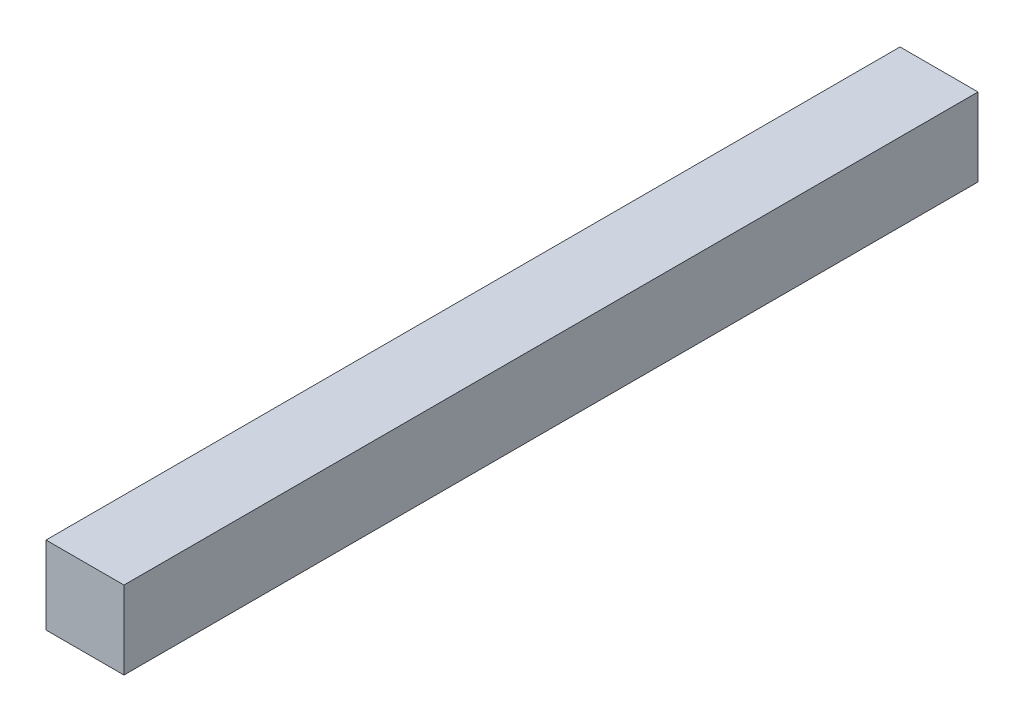
ISO-10303-21;
HEADER;
FILE_DESCRIPTION(('STEP AP214'),'2;1');
FILE_NAME('part.step','',(''),(''),'','','');
FILE_SCHEMA(('AUTOMOTIVE_DESIGN { 1 0 10303 214 1 1 1 1 }'));
ENDSEC;
DATA;
#1=APPLICATION_CONTEXT('core data for automotive mechanical design processes');
#2=APPLICATION_PROTOCOL_DEFINITION('international standard','automotive_design',2000,#1);
#3=PRODUCT_CONTEXT('',#1,'mechanical');
#4=PRODUCT('Part','Part','',(#3));
#5=PRODUCT_RELATED_PRODUCT_CATEGORY('part','',(#4));
#6=PRODUCT_DEFINITION_FORMATION('','',#4);
#7=PRODUCT_DEFINITION_CONTEXT('part definition',#1,'design');
#8=PRODUCT_DEFINITION('design','',#6,#7);
#9=PRODUCT_DEFINITION_SHAPE('','',#8);
#10=(LENGTH_UNIT() NAMED_UNIT(*) SI_UNIT(.MILLI.,.METRE.));
#11=(NAMED_UNIT(*) PLANE_ANGLE_UNIT() SI_UNIT($,.RADIAN.));
#12=(NAMED_UNIT(*) SI_UNIT($,.STERADIAN.) SOLID_ANGLE_UNIT());
#13=UNCERTAINTY_MEASURE_WITH_UNIT(LENGTH_MEASURE(1.E-05),#10,'distance_accuracy_value','');
#14=(GEOMETRIC_REPRESENTATION_CONTEXT(3) GLOBAL_UNCERTAINTY_ASSIGNED_CONTEXT((#13)) GLOBAL_UNIT_ASSIGNED_CONTEXT((#10,
#11,#12)) REPRESENTATION_CONTEXT('',''));
#15=CARTESIAN_POINT('',(0.,0.,0.));
#16=DIRECTION('',(0.,0.,1.));
#17=DIRECTION('',(1.,0.,0.));
#18=AXIS2_PLACEMENT_3D('',#15,#16,#17);
#19=CARTESIAN_POINT('',(21.,0.,460.));
#20=DIRECTION('',(-1.,0.,0.));
#21=DIRECTION('',(0.,0.,1.));
#22=AXIS2_PLACEMENT_3D('',#19,#20,#21);
#23=PLANE('',#22);
#24=DIRECTION('',(0.,1.,0.));
#25=VECTOR('',#24,1.);
#26=CARTESIAN_POINT('',(21.,0.,0.));
#27=LINE('',#26,#25);
#28=CARTESIAN_POINT('',(21.,-21.,0.));
#29=VERTEX_POINT('',#28);
#30=CARTESIAN_POINT('',(21.,21.,0.));
#31=VERTEX_POINT('',#30);
#32=EDGE_CURVE('E125',#29,#31,#27,.T.);
#33=ORIENTED_EDGE('',*,*,#32,.T.);
#34=DIRECTION('',(0.,0.,-1.));
#35=VECTOR('',#34,1.);
#36=CARTESIAN_POINT('',(21.,21.,460.));
#37=LINE('',#36,#35);
#38=CARTESIAN_POINT('',(21.,21.,460.));
#39=VERTEX_POINT('',#38);
#40=EDGE_CURVE('E73',#39,#31,#37,.T.);
#41=ORIENTED_EDGE('',*,*,#40,.F.);
#42=DIRECTION('',(0.,1.,0.));
#43=VECTOR('',#42,1.);
#44=CARTESIAN_POINT('',(21.,0.,460.));
#45=LINE('',#44,#43);
#46=CARTESIAN_POINT('',(21.,-21.,460.));
#47=VERTEX_POINT('',#46);
#48=EDGE_CURVE('E116',#47,#39,#45,.T.);
#49=ORIENTED_EDGE('',*,*,#48,.F.);
#50=DIRECTION('',(0.,0.,-1.));
#51=VECTOR('',#50,1.);
#52=CARTESIAN_POINT('',(21.,-21.,460.));
#53=LINE('',#52,#51);
#54=EDGE_CURVE('E12',#47,#29,#53,.T.);
#55=ORIENTED_EDGE('',*,*,#54,.T.);
#56=EDGE_LOOP('',(#33,#41,#49,#55));
#57=FACE_BOUND('',#56,.T.);
#58=ADVANCED_FACE('F63',(#57),#23,.F.);
#59=CARTESIAN_POINT('',(0.,21.,460.));
#60=DIRECTION('',(0.,-1.,0.));
#61=DIRECTION('',(1.,0.,0.));
#62=AXIS2_PLACEMENT_3D('',#59,#60,#61);
#63=PLANE('',#62);
#64=DIRECTION('',(-1.,0.,0.));
#65=VECTOR('',#64,1.);
#66=CARTESIAN_POINT('',(0.,21.,0.));
#67=LINE('',#66,#65);
#68=CARTESIAN_POINT('',(-21.,21.,0.));
#69=VERTEX_POINT('',#68);
#70=EDGE_CURVE('E136',#31,#69,#67,.T.);
#71=ORIENTED_EDGE('',*,*,#70,.T.);
#72=DIRECTION('',(0.,0.,-1.));
#73=VECTOR('',#72,1.);
#74=CARTESIAN_POINT('',(-21.,21.,460.));
#75=LINE('',#74,#73);
#76=CARTESIAN_POINT('',(-21.,21.,460.));
#77=VERTEX_POINT('',#76);
#78=EDGE_CURVE('E95',#77,#69,#75,.T.);
#79=ORIENTED_EDGE('',*,*,#78,.F.);
#80=DIRECTION('',(-1.,0.,0.));
#81=VECTOR('',#80,1.);
#82=CARTESIAN_POINT('',(0.,21.,460.));
#83=LINE('',#82,#81);
#84=EDGE_CURVE('E107',#39,#77,#83,.T.);
#85=ORIENTED_EDGE('',*,*,#84,.F.);
#86=ORIENTED_EDGE('',*,*,#40,.T.);
#87=EDGE_LOOP('',(#71,#79,#85,#86));
#88=FACE_BOUND('',#87,.T.);
#89=ADVANCED_FACE('F109',(#88),#63,.F.);
#90=CARTESIAN_POINT('',(-21.,0.,460.));
#91=DIRECTION('',(-1.,0.,0.));
#92=DIRECTION('',(0.,0.,1.));
#93=AXIS2_PLACEMENT_3D('',#90,#91,#92);
#94=PLANE('',#93);
#95=DIRECTION('',(0.,1.,0.));
#96=VECTOR('',#95,1.);
#97=CARTESIAN_POINT('',(-21.,0.,0.));
#98=LINE('',#97,#96);
#99=CARTESIAN_POINT('',(-21.,-21.,0.));
#100=VERTEX_POINT('',#99);
#101=EDGE_CURVE('E132',#100,#69,#98,.T.);
#102=ORIENTED_EDGE('',*,*,#101,.F.);
#103=DIRECTION('',(0.,0.,-1.));
#104=VECTOR('',#103,1.);
#105=CARTESIAN_POINT('',(-21.,-21.,460.));
#106=LINE('',#105,#104);
#107=CARTESIAN_POINT('',(-21.,-21.,460.));
#108=VERTEX_POINT('',#107);
#109=EDGE_CURVE('E81',#108,#100,#106,.T.);
#110=ORIENTED_EDGE('',*,*,#109,.F.);
#111=DIRECTION('',(0.,1.,0.));
#112=VECTOR('',#111,1.);
#113=CARTESIAN_POINT('',(-21.,0.,460.));
#114=LINE('',#113,#112);
#115=EDGE_CURVE('E115',#108,#77,#114,.T.);
#116=ORIENTED_EDGE('',*,*,#115,.T.);
#117=ORIENTED_EDGE('',*,*,#78,.T.);
#118=EDGE_LOOP('',(#102,#110,#116,#117));
#119=FACE_BOUND('',#118,.T.);
#120=ADVANCED_FACE('F147',(#119),#94,.T.);
#121=CARTESIAN_POINT('',(0.,-21.,460.));
#122=DIRECTION('',(0.,-1.,0.));
#123=DIRECTION('',(1.,0.,0.));
#124=AXIS2_PLACEMENT_3D('',#121,#122,#123);
#125=PLANE('',#124);
#126=DIRECTION('',(-1.,0.,0.));
#127=VECTOR('',#126,1.);
#128=CARTESIAN_POINT('',(0.,-21.,0.));
#129=LINE('',#128,#127);
#130=EDGE_CURVE('E141',#29,#100,#129,.T.);
#131=ORIENTED_EDGE('',*,*,#130,.F.);
#132=ORIENTED_EDGE('',*,*,#54,.F.);
#133=DIRECTION('',(-1.,0.,0.));
#134=VECTOR('',#133,1.);
#135=CARTESIAN_POINT('',(0.,-21.,460.));
#136=LINE('',#135,#134);
#137=EDGE_CURVE('E120',#47,#108,#136,.T.);
#138=ORIENTED_EDGE('',*,*,#137,.T.);
#139=ORIENTED_EDGE('',*,*,#109,.T.);
#140=EDGE_LOOP('',(#131,#132,#138,#139));
#141=FACE_BOUND('',#140,.T.);
#142=ADVANCED_FACE('F65',(#141),#125,.T.);
#143=CARTESIAN_POINT('',(0.,0.,0.));
#144=DIRECTION('',(0.,0.,1.));
#145=DIRECTION('',(1.,0.,0.));
#146=AXIS2_PLACEMENT_3D('',#143,#144,#145);
#147=PLANE('',#146);
#148=ORIENTED_EDGE('',*,*,#130,.T.);
#149=ORIENTED_EDGE('',*,*,#101,.T.);
#150=ORIENTED_EDGE('',*,*,#70,.F.);
#151=ORIENTED_EDGE('',*,*,#32,.F.);
#152=EDGE_LOOP('',(#148,#149,#150,#151));
#153=FACE_BOUND('',#152,.T.);
#154=ADVANCED_FACE('F154',(#153),#147,.F.);
#155=CARTESIAN_POINT('',(0.,0.,460.));
#156=DIRECTION('',(0.,0.,1.));
#157=DIRECTION('',(1.,0.,0.));
#158=AXIS2_PLACEMENT_3D('',#155,#156,#157);
#159=PLANE('',#158);
#160=ORIENTED_EDGE('',*,*,#137,.F.);
#161=ORIENTED_EDGE('',*,*,#48,.T.);
#162=ORIENTED_EDGE('',*,*,#84,.T.);
#163=ORIENTED_EDGE('',*,*,#115,.F.);
#164=EDGE_LOOP('',(#160,#161,#162,#163));
#165=FACE_BOUND('',#164,.T.);
#166=ADVANCED_FACE('F119',(#165),#159,.T.);
#167=CLOSED_SHELL('',(#58,#89,#120,#142,#154,#166));
#168=MANIFOLD_SOLID_BREP('B2',#167);
#169=ADVANCED_BREP_SHAPE_REPRESENTATION('',(#18,#168),#14);
#170=SHAPE_DEFINITION_REPRESENTATION(#9,#169);
ENDSEC;
END-ISO-10303-21;
